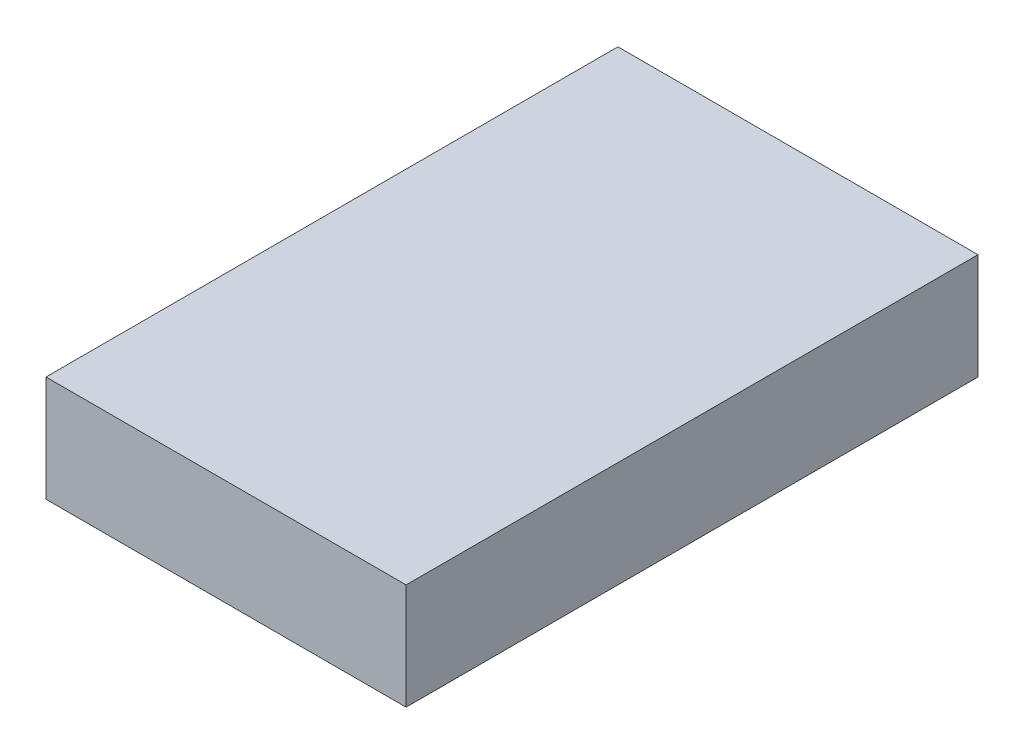
ISO-10303-21;
HEADER;
FILE_DESCRIPTION(('STEP AP214'),'2;1');
FILE_NAME('part.step','',(''),(''),'','','');
FILE_SCHEMA(('AUTOMOTIVE_DESIGN { 1 0 10303 214 1 1 1 1 }'));
ENDSEC;
DATA;
#1=APPLICATION_CONTEXT('core data for automotive mechanical design processes');
#2=APPLICATION_PROTOCOL_DEFINITION('international standard','automotive_design',2000,#1);
#3=PRODUCT_CONTEXT('',#1,'mechanical');
#4=PRODUCT('Part','Part','',(#3));
#5=PRODUCT_RELATED_PRODUCT_CATEGORY('part','',(#4));
#6=PRODUCT_DEFINITION_FORMATION('','',#4);
#7=PRODUCT_DEFINITION_CONTEXT('part definition',#1,'design');
#8=PRODUCT_DEFINITION('design','',#6,#7);
#9=PRODUCT_DEFINITION_SHAPE('','',#8);
#10=(LENGTH_UNIT() NAMED_UNIT(*) SI_UNIT(.MILLI.,.METRE.));
#11=(NAMED_UNIT(*) PLANE_ANGLE_UNIT() SI_UNIT($,.RADIAN.));
#12=(NAMED_UNIT(*) SI_UNIT($,.STERADIAN.) SOLID_ANGLE_UNIT());
#13=UNCERTAINTY_MEASURE_WITH_UNIT(LENGTH_MEASURE(1.E-05),#10,'distance_accuracy_value','');
#14=(GEOMETRIC_REPRESENTATION_CONTEXT(3) GLOBAL_UNCERTAINTY_ASSIGNED_CONTEXT((#13)) GLOBAL_UNIT_ASSIGNED_CONTEXT((#10,
#11,#12)) REPRESENTATION_CONTEXT('',''));
#15=CARTESIAN_POINT('',(0.,0.,0.));
#16=DIRECTION('',(0.,0.,1.));
#17=DIRECTION('',(1.,0.,0.));
#18=AXIS2_PLACEMENT_3D('',#15,#16,#17);
#19=CARTESIAN_POINT('',(0.68,0.4,-1.08));
#20=DIRECTION('',(-1.,0.,0.));
#21=DIRECTION('',(0.,0.,1.));
#22=AXIS2_PLACEMENT_3D('',#19,#20,#21);
#23=PLANE('',#22);
#24=DIRECTION('',(0.,0.,-1.));
#25=VECTOR('',#24,1.);
#26=CARTESIAN_POINT('',(0.68,0.,-1.08));
#27=LINE('',#26,#25);
#28=CARTESIAN_POINT('',(0.68,0.,1.08));
#29=VERTEX_POINT('',#28);
#30=CARTESIAN_POINT('',(0.68,0.,-1.08));
#31=VERTEX_POINT('',#30);
#32=EDGE_CURVE('E98',#29,#31,#27,.T.);
#33=ORIENTED_EDGE('',*,*,#32,.T.);
#34=DIRECTION('',(0.,-1.,0.));
#35=VECTOR('',#34,1.);
#36=CARTESIAN_POINT('',(0.68,0.4,-1.08));
#37=LINE('',#36,#35);
#38=CARTESIAN_POINT('',(0.68,0.4,-1.08));
#39=VERTEX_POINT('',#38);
#40=EDGE_CURVE('E11',#39,#31,#37,.T.);
#41=ORIENTED_EDGE('',*,*,#40,.F.);
#42=DIRECTION('',(0.,0.,-1.));
#43=VECTOR('',#42,1.);
#44=CARTESIAN_POINT('',(0.68,0.4,-1.08));
#45=LINE('',#44,#43);
#46=CARTESIAN_POINT('',(0.68,0.4,1.08));
#47=VERTEX_POINT('',#46);
#48=EDGE_CURVE('E86',#47,#39,#45,.T.);
#49=ORIENTED_EDGE('',*,*,#48,.F.);
#50=DIRECTION('',(0.,-1.,0.));
#51=VECTOR('',#50,1.);
#52=CARTESIAN_POINT('',(0.68,0.4,1.08));
#53=LINE('',#52,#51);
#54=EDGE_CURVE('E94',#47,#29,#53,.T.);
#55=ORIENTED_EDGE('',*,*,#54,.T.);
#56=EDGE_LOOP('',(#33,#41,#49,#55));
#57=FACE_BOUND('',#56,.T.);
#58=ADVANCED_FACE('F35',(#57),#23,.F.);
#59=CARTESIAN_POINT('',(-0.68,0.4,-1.08));
#60=DIRECTION('',(0.,0.,1.));
#61=DIRECTION('',(1.,0.,0.));
#62=AXIS2_PLACEMENT_3D('',#59,#60,#61);
#63=PLANE('',#62);
#64=DIRECTION('',(-1.,0.,0.));
#65=VECTOR('',#64,1.);
#66=CARTESIAN_POINT('',(-0.68,0.,-1.08));
#67=LINE('',#66,#65);
#68=CARTESIAN_POINT('',(-0.68,0.,-1.08));
#69=VERTEX_POINT('',#68);
#70=EDGE_CURVE('E90',#31,#69,#67,.T.);
#71=ORIENTED_EDGE('',*,*,#70,.T.);
#72=DIRECTION('',(0.,-1.,0.));
#73=VECTOR('',#72,1.);
#74=CARTESIAN_POINT('',(-0.68,0.4,-1.08));
#75=LINE('',#74,#73);
#76=CARTESIAN_POINT('',(-0.68,0.4,-1.08));
#77=VERTEX_POINT('',#76);
#78=EDGE_CURVE('E43',#77,#69,#75,.T.);
#79=ORIENTED_EDGE('',*,*,#78,.F.);
#80=DIRECTION('',(-1.,0.,0.));
#81=VECTOR('',#80,1.);
#82=CARTESIAN_POINT('',(-0.68,0.4,-1.08));
#83=LINE('',#82,#81);
#84=EDGE_CURVE('E81',#39,#77,#83,.T.);
#85=ORIENTED_EDGE('',*,*,#84,.F.);
#86=ORIENTED_EDGE('',*,*,#40,.T.);
#87=EDGE_LOOP('',(#71,#79,#85,#86));
#88=FACE_BOUND('',#87,.T.);
#89=ADVANCED_FACE('F89',(#88),#63,.F.);
#90=CARTESIAN_POINT('',(-0.68,0.4,-1.08));
#91=DIRECTION('',(1.,0.,0.));
#92=DIRECTION('',(0.,0.,-1.));
#93=AXIS2_PLACEMENT_3D('',#90,#91,#92);
#94=PLANE('',#93);
#95=DIRECTION('',(0.,0.,1.));
#96=VECTOR('',#95,1.);
#97=CARTESIAN_POINT('',(-0.68,0.,-1.08));
#98=LINE('',#97,#96);
#99=CARTESIAN_POINT('',(-0.68,0.,1.08));
#100=VERTEX_POINT('',#99);
#101=EDGE_CURVE('E68',#69,#100,#98,.T.);
#102=ORIENTED_EDGE('',*,*,#101,.T.);
#103=DIRECTION('',(0.,-1.,0.));
#104=VECTOR('',#103,1.);
#105=CARTESIAN_POINT('',(-0.68,0.4,1.08));
#106=LINE('',#105,#104);
#107=CARTESIAN_POINT('',(-0.68,0.4,1.08));
#108=VERTEX_POINT('',#107);
#109=EDGE_CURVE('E91',#108,#100,#106,.T.);
#110=ORIENTED_EDGE('',*,*,#109,.F.);
#111=DIRECTION('',(0.,0.,1.));
#112=VECTOR('',#111,1.);
#113=CARTESIAN_POINT('',(-0.68,0.4,-1.08));
#114=LINE('',#113,#112);
#115=EDGE_CURVE('E84',#77,#108,#114,.T.);
#116=ORIENTED_EDGE('',*,*,#115,.F.);
#117=ORIENTED_EDGE('',*,*,#78,.T.);
#118=EDGE_LOOP('',(#102,#110,#116,#117));
#119=FACE_BOUND('',#118,.T.);
#120=ADVANCED_FACE('F92',(#119),#94,.F.);
#121=CARTESIAN_POINT('',(-0.68,0.4,1.08));
#122=DIRECTION('',(0.,0.,-1.));
#123=DIRECTION('',(-1.,0.,0.));
#124=AXIS2_PLACEMENT_3D('',#121,#122,#123);
#125=PLANE('',#124);
#126=DIRECTION('',(1.,0.,0.));
#127=VECTOR('',#126,1.);
#128=CARTESIAN_POINT('',(-0.68,0.,1.08));
#129=LINE('',#128,#127);
#130=EDGE_CURVE('E74',#100,#29,#129,.T.);
#131=ORIENTED_EDGE('',*,*,#130,.T.);
#132=ORIENTED_EDGE('',*,*,#54,.F.);
#133=DIRECTION('',(1.,0.,0.));
#134=VECTOR('',#133,1.);
#135=CARTESIAN_POINT('',(-0.68,0.4,1.08));
#136=LINE('',#135,#134);
#137=EDGE_CURVE('E51',#108,#47,#136,.T.);
#138=ORIENTED_EDGE('',*,*,#137,.F.);
#139=ORIENTED_EDGE('',*,*,#109,.T.);
#140=EDGE_LOOP('',(#131,#132,#138,#139));
#141=FACE_BOUND('',#140,.T.);
#142=ADVANCED_FACE('F105',(#141),#125,.F.);
#143=CARTESIAN_POINT('',(0.,0.4,0.));
#144=DIRECTION('',(0.,1.,0.));
#145=DIRECTION('',(0.,0.,1.));
#146=AXIS2_PLACEMENT_3D('',#143,#144,#145);
#147=PLANE('',#146);
#148=ORIENTED_EDGE('',*,*,#48,.T.);
#149=ORIENTED_EDGE('',*,*,#84,.T.);
#150=ORIENTED_EDGE('',*,*,#115,.T.);
#151=ORIENTED_EDGE('',*,*,#137,.T.);
#152=EDGE_LOOP('',(#148,#149,#150,#151));
#153=FACE_BOUND('',#152,.T.);
#154=ADVANCED_FACE('F82',(#153),#147,.T.);
#155=CARTESIAN_POINT('',(0.,0.,0.));
#156=DIRECTION('',(0.,1.,0.));
#157=DIRECTION('',(0.,0.,1.));
#158=AXIS2_PLACEMENT_3D('',#155,#156,#157);
#159=PLANE('',#158);
#160=ORIENTED_EDGE('',*,*,#32,.F.);
#161=ORIENTED_EDGE('',*,*,#130,.F.);
#162=ORIENTED_EDGE('',*,*,#101,.F.);
#163=ORIENTED_EDGE('',*,*,#70,.F.);
#164=EDGE_LOOP('',(#160,#161,#162,#163));
#165=FACE_BOUND('',#164,.T.);
#166=ADVANCED_FACE('F108',(#165),#159,.F.);
#167=CLOSED_SHELL('',(#58,#89,#120,#142,#154,#166));
#168=MANIFOLD_SOLID_BREP('B2',#167);
#169=ADVANCED_BREP_SHAPE_REPRESENTATION('',(#18,#168),#14);
#170=SHAPE_DEFINITION_REPRESENTATION(#9,#169);
ENDSEC;
END-ISO-10303-21;
